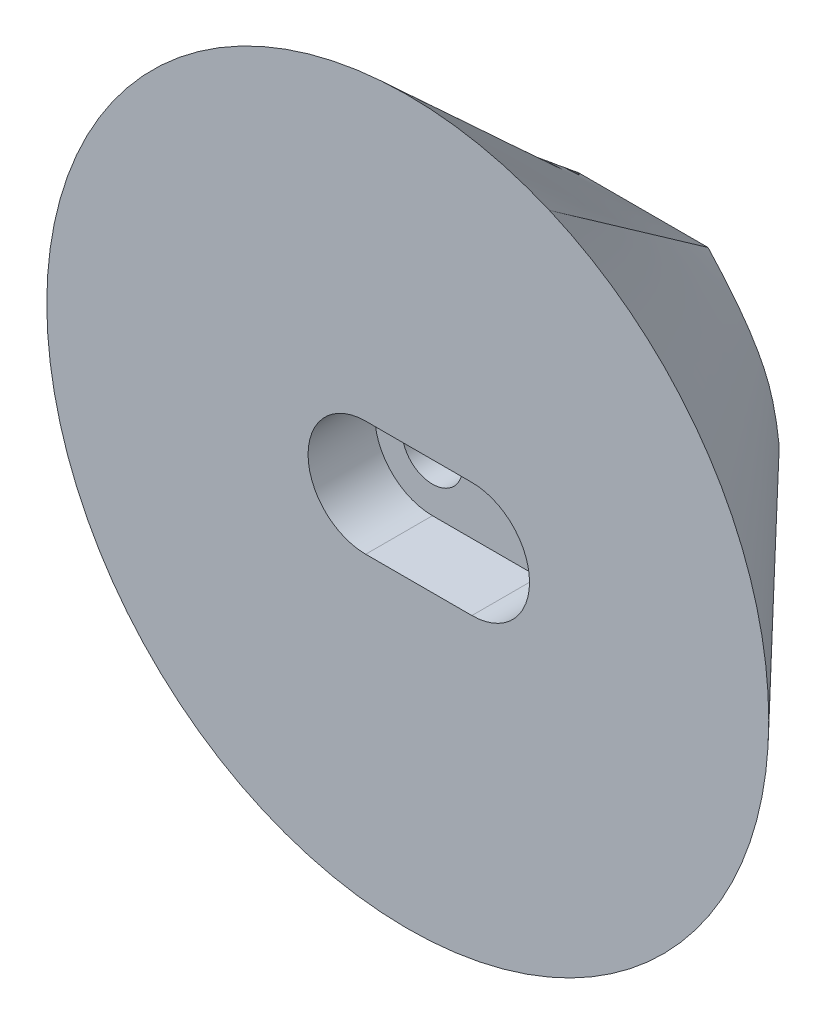
ISO-10303-21;
HEADER;
FILE_DESCRIPTION(('STEP AP214'),'2;1');
FILE_NAME('part.step','',(''),(''),'','','');
FILE_SCHEMA(('AUTOMOTIVE_DESIGN { 1 0 10303 214 1 1 1 1 }'));
ENDSEC;
DATA;
#1=APPLICATION_CONTEXT('core data for automotive mechanical design processes');
#2=APPLICATION_PROTOCOL_DEFINITION('international standard','automotive_design',2000,#1);
#3=PRODUCT_CONTEXT('',#1,'mechanical');
#4=PRODUCT('Part','Part','',(#3));
#5=PRODUCT_RELATED_PRODUCT_CATEGORY('part','',(#4));
#6=PRODUCT_DEFINITION_FORMATION('','',#4);
#7=PRODUCT_DEFINITION_CONTEXT('part definition',#1,'design');
#8=PRODUCT_DEFINITION('design','',#6,#7);
#9=PRODUCT_DEFINITION_SHAPE('','',#8);
#10=(LENGTH_UNIT() NAMED_UNIT(*) SI_UNIT(.MILLI.,.METRE.));
#11=(NAMED_UNIT(*) PLANE_ANGLE_UNIT() SI_UNIT($,.RADIAN.));
#12=(NAMED_UNIT(*) SI_UNIT($,.STERADIAN.) SOLID_ANGLE_UNIT());
#13=UNCERTAINTY_MEASURE_WITH_UNIT(LENGTH_MEASURE(1.E-05),#10,'distance_accuracy_value','');
#14=(GEOMETRIC_REPRESENTATION_CONTEXT(3) GLOBAL_UNCERTAINTY_ASSIGNED_CONTEXT((#13)) GLOBAL_UNIT_ASSIGNED_CONTEXT((#10,
#11,#12)) REPRESENTATION_CONTEXT('',''));
#15=CARTESIAN_POINT('',(0.,0.,0.));
#16=DIRECTION('',(0.,0.,1.));
#17=DIRECTION('',(1.,0.,0.));
#18=AXIS2_PLACEMENT_3D('',#15,#16,#17);
#19=CARTESIAN_POINT('',(2.11342609421527,0.,-2.));
#20=DIRECTION('',(0.,0.,1.));
#21=DIRECTION('',(1.,0.,0.));
#22=AXIS2_PLACEMENT_3D('',#19,#20,#21);
#23=CYLINDRICAL_SURFACE('',#22,1.);
#24=CARTESIAN_POINT('',(2.11342609421527,0.,0.));
#25=DIRECTION('',(0.,0.,-1.));
#26=DIRECTION('',(-1.,0.,0.));
#27=AXIS2_PLACEMENT_3D('',#24,#25,#26);
#28=CIRCLE('',#27,1.);
#29=CARTESIAN_POINT('',(1.11342609421527,0.,0.));
#30=VERTEX_POINT('',#29);
#31=EDGE_CURVE('E264',#30,#30,#28,.T.);
#32=ORIENTED_EDGE('',*,*,#31,.T.);
#33=EDGE_LOOP('',(#32));
#34=FACE_BOUND('',#33,.T.);
#35=CARTESIAN_POINT('',(2.11342609421527,0.,5.8));
#36=DIRECTION('',(0.,0.,1.));
#37=DIRECTION('',(1.,0.,0.));
#38=AXIS2_PLACEMENT_3D('',#35,#36,#37);
#39=CIRCLE('',#38,1.);
#40=CARTESIAN_POINT('',(3.11342609421527,0.,5.8));
#41=VERTEX_POINT('',#40);
#42=EDGE_CURVE('E260',#41,#41,#39,.F.);
#43=ORIENTED_EDGE('',*,*,#42,.F.);
#44=EDGE_LOOP('',(#43));
#45=FACE_BOUND('',#44,.T.);
#46=ADVANCED_FACE('F137',(#34,#45),#23,.F.);
#47=CARTESIAN_POINT('',(-1.38657390578473,0.,-2.));
#48=DIRECTION('',(0.,0.,1.));
#49=DIRECTION('',(1.,0.,0.));
#50=AXIS2_PLACEMENT_3D('',#47,#48,#49);
#51=CYLINDRICAL_SURFACE('',#50,1.);
#52=CARTESIAN_POINT('',(-1.38657390578473,0.,0.));
#53=DIRECTION('',(0.,0.,-1.));
#54=DIRECTION('',(-1.,0.,0.));
#55=AXIS2_PLACEMENT_3D('',#52,#53,#54);
#56=CIRCLE('',#55,1.);
#57=CARTESIAN_POINT('',(-2.38657390578473,0.,0.));
#58=VERTEX_POINT('',#57);
#59=EDGE_CURVE('E268',#58,#58,#56,.T.);
#60=ORIENTED_EDGE('',*,*,#59,.T.);
#61=EDGE_LOOP('',(#60));
#62=FACE_BOUND('',#61,.T.);
#63=CARTESIAN_POINT('',(-1.38657390578473,0.,5.8));
#64=DIRECTION('',(0.,0.,1.));
#65=DIRECTION('',(1.,0.,0.));
#66=AXIS2_PLACEMENT_3D('',#63,#64,#65);
#67=CIRCLE('',#66,1.);
#68=CARTESIAN_POINT('',(-0.386573905784727,0.,5.8));
#69=VERTEX_POINT('',#68);
#70=EDGE_CURVE('E142',#69,#69,#67,.F.);
#71=ORIENTED_EDGE('',*,*,#70,.F.);
#72=EDGE_LOOP('',(#71));
#73=FACE_BOUND('',#72,.T.);
#74=ADVANCED_FACE('F508',(#62,#73),#51,.F.);
#75=CARTESIAN_POINT('',(-2.9114265083145,-2.03828227090271,0.));
#76=DIRECTION('',(0.,0.,-1.));
#77=DIRECTION('',(-1.,0.,0.));
#78=AXIS2_PLACEMENT_3D('',#75,#76,#77);
#79=PLANE('',#78);
#80=ORIENTED_EDGE('',*,*,#59,.F.);
#81=EDGE_LOOP('',(#80));
#82=FACE_BOUND('',#81,.T.);
#83=ORIENTED_EDGE('',*,*,#31,.F.);
#84=EDGE_LOOP('',(#83));
#85=FACE_BOUND('',#84,.T.);
#86=CARTESIAN_POINT('',(-4.2444684424018,0.,0.));
#87=CARTESIAN_POINT('',(-4.24446844240179,-0.107452137173839,0.));
#88=CARTESIAN_POINT('',(-4.23748466742272,-0.21405566133606,0.));
#89=CARTESIAN_POINT('',(-4.1957781377489,-0.423892088590512,0.));
#90=CARTESIAN_POINT('',(-4.16070837934454,-0.527272439571958,0.));
#91=CARTESIAN_POINT('',(-4.03642800277879,-0.704643229518786,0.));
#92=CARTESIAN_POINT('',(-3.95135915448995,-0.772693372705895,0.));
#93=CARTESIAN_POINT('',(-3.76877677289554,-0.88744750748211,0.));
#94=CARTESIAN_POINT('',(-3.67237685578229,-0.936320531094865,0.));
#95=CARTESIAN_POINT('',(-3.48913373849145,-1.0499747977359,0.));
#96=CARTESIAN_POINT('',(-3.40296696979009,-1.1134642149528,0.));
#97=CARTESIAN_POINT('',(-3.25410794137238,-1.26441937833438,0.));
#98=CARTESIAN_POINT('',(-3.18968714114727,-1.35285361970208,0.));
#99=CARTESIAN_POINT('',(-3.02971312698185,-1.63004372531452,0.));
#100=CARTESIAN_POINT('',(-2.96379094531494,-1.83140529367522,0.));
#101=CARTESIAN_POINT('',(-2.85906207131406,-2.2451592481302,0.));
#102=CARTESIAN_POINT('',(-2.8220385375043,-2.45532924702613,0.));
#103=CARTESIAN_POINT('',(-2.75723498235252,-2.87636464168828,0.));
#104=CARTESIAN_POINT('',(-2.72978803805141,-3.08767854822898,0.));
#105=CARTESIAN_POINT('',(-2.67187097706575,-3.50982055733704,0.));
#106=CARTESIAN_POINT('',(-2.64207653474063,-3.72086596333578,0.));
#107=CARTESIAN_POINT('',(-2.58181607741194,-4.03414721985315,0.));
#108=CARTESIAN_POINT('',(-2.55933842948337,-4.13807708960366,0.));
#109=CARTESIAN_POINT('',(-2.51388823216451,-4.29153165547058,0.));
#110=CARTESIAN_POINT('',(-2.49689650721585,-4.34260776258866,0.));
#111=CARTESIAN_POINT('',(-2.46266282229695,-4.41485926277032,0.));
#112=CARTESIAN_POINT('',(-2.44970915023529,-4.43866246966747,0.));
#113=CARTESIAN_POINT('',(-2.4159113647867,-4.48053300000075,0.));
#114=CARTESIAN_POINT('',(-2.39304628903056,-4.49993783999961,0.));
#115=CARTESIAN_POINT('',(-2.36567545377195,-4.49999984696238,0.));
#116=B_SPLINE_CURVE_WITH_KNOTS('',3,(#86,#87,#88,#89,#90,#91,#92,#93,#94,#95,#96,#97,#98,#99,
#100,#101,#102,#103,#104,#105,#106,#107,#108,#109,#110,#111,#112,#113,#114,#115),.UNSPECIFIED.,
.F.,.F.,(4,2,2,2,2,2,2,2,2,2,2,2,2,2,4),(0.,0.0624999999999999,0.125,0.1875,0.25,0.3125,0.375,
0.5,0.625,0.75,0.875000000000001,0.937500000000001,0.968750000000001,0.984375,1.),.UNSPECIFIED.);
#117=CARTESIAN_POINT('',(-4.2444684424018,0.,0.));
#118=VERTEX_POINT('',#117);
#119=CARTESIAN_POINT('',(-2.36567544377861,-4.4999433225368,0.));
#120=VERTEX_POINT('',#119);
#121=EDGE_CURVE('E332',#118,#120,#116,.T.);
#122=ORIENTED_EDGE('',*,*,#121,.F.);
#123=CARTESIAN_POINT('',(-2.36567641502914,4.49999984477696,0.));
#124=CARTESIAN_POINT('',(-2.39266723234827,4.49993826362158,0.));
#125=CARTESIAN_POINT('',(-2.41523918985877,4.4811286371027,0.));
#126=CARTESIAN_POINT('',(-2.44901158075446,4.43975431880796,0.));
#127=CARTESIAN_POINT('',(-2.46179946218254,4.41647004850654,0.));
#128=CARTESIAN_POINT('',(-2.49620325571585,4.34447208449066,0.));
#129=CARTESIAN_POINT('',(-2.51310662561795,4.2938925011295,0.));
#130=CARTESIAN_POINT('',(-2.55863010921527,4.14100451994068,0.));
#131=CARTESIAN_POINT('',(-2.58121900656018,4.03695619625527,0.));
#132=CARTESIAN_POINT('',(-2.64162849403424,3.72377349616821,0.));
#133=CARTESIAN_POINT('',(-2.67139933409105,3.51312492128009,0.));
#134=CARTESIAN_POINT('',(-2.72926944644447,3.09158948704992,0.));
#135=CARTESIAN_POINT('',(-2.75666763726496,2.88053651848335,0.));
#136=CARTESIAN_POINT('',(-2.82120962184821,2.46023942385809,0.));
#137=CARTESIAN_POINT('',(-2.85794191936113,2.2509189216211,0.));
#138=CARTESIAN_POINT('',(-2.96181370830197,1.83792167518118,0.));
#139=CARTESIAN_POINT('',(-3.02930181937602,1.63107975854107,0.));
#140=CARTESIAN_POINT('',(-3.18903039751784,1.35383120128005,0.));
#141=CARTESIAN_POINT('',(-3.25319092695218,1.26539867427861,0.));
#142=CARTESIAN_POINT('',(-3.40339892322715,1.1129769694454,0.));
#143=CARTESIAN_POINT('',(-3.49079497620113,1.0488324233786,0.));
#144=CARTESIAN_POINT('',(-3.67411262886622,0.935358050885582,0.));
#145=CARTESIAN_POINT('',(-3.770740337577,0.886358904806014,0.));
#146=CARTESIAN_POINT('',(-3.90705110667896,0.8004666264081,0.));
#147=CARTESIAN_POINT('',(-3.95083902183506,0.769620440930179,0.));
#148=CARTESIAN_POINT('',(-4.03172144220608,0.698935538955371,0.));
#149=CARTESIAN_POINT('',(-4.06895513185411,0.658465438766408,0.));
#150=CARTESIAN_POINT('',(-4.16059758035169,0.52693048284131,0.));
#151=CARTESIAN_POINT('',(-4.1962647937693,0.422001690668502,0.));
#152=CARTESIAN_POINT('',(-4.23746728012239,0.213578666792449,0.));
#153=CARTESIAN_POINT('',(-4.2444684424018,0.107317024848092,0.));
#154=CARTESIAN_POINT('',(-4.2444684424018,0.,0.));
#155=B_SPLINE_CURVE_WITH_KNOTS('',3,(#123,#124,#125,#126,#127,#128,#129,#130,#131,#132,#133,
#134,#135,#136,#137,#138,#139,#140,#141,#142,#143,#144,#145,#146,#147,#148,#149,#150,#151,#152,
#153,#154),.UNSPECIFIED.,.F.,.F.,(4,2,2,2,2,2,2,2,2,2,2,2,2,2,2,4),(0.,0.0156250000000003,
0.0312500000000007,0.0625000000000006,0.125000000000001,0.25,0.375,0.5,0.625,0.6875,0.75,0.8125,
0.84375,0.875,0.9375,1.),.UNSPECIFIED.);
#156=CARTESIAN_POINT('',(-2.36567640349646,4.49994292130398,0.));
#157=VERTEX_POINT('',#156);
#158=EDGE_CURVE('E12',#157,#118,#155,.T.);
#159=ORIENTED_EDGE('',*,*,#158,.F.);
#160=DIRECTION('',(-0.999999999999999,-3.64033009505512E-08,0.));
#161=VECTOR('',#160,1.);
#162=CARTESIAN_POINT('',(1.89830628163759,4.50000000000001,0.));
#163=LINE('',#162,#161);
#164=CARTESIAN_POINT('',(1.89830628163759,4.50000000000001,0.));
#165=VERTEX_POINT('',#164);
#166=EDGE_CURVE('E148',#165,#157,#163,.T.);
#167=ORIENTED_EDGE('',*,*,#166,.F.);
#168=CARTESIAN_POINT('',(4.24446844240487,0.,0.));
#169=CARTESIAN_POINT('',(4.19297694506029,0.431086302225914,0.));
#170=CARTESIAN_POINT('',(4.12394759057546,0.85874194869877,0.));
#171=CARTESIAN_POINT('',(3.94453324890741,1.48538410038366,0.));
#172=CARTESIAN_POINT('',(3.87116008839568,1.68994340914965,0.));
#173=CARTESIAN_POINT('',(3.69485829722378,2.08357662911512,0.));
#174=CARTESIAN_POINT('',(3.59202500957753,2.27356174145487,0.));
#175=CARTESIAN_POINT('',(3.26500305794106,2.83489902735797,0.));
#176=CARTESIAN_POINT('',(3.01342528947052,3.18642479209752,0.));
#177=CARTESIAN_POINT('',(2.47470252128366,3.85804242651396,0.));
#178=CARTESIAN_POINT('',(2.18944713101147,4.18133800367739,0.));
#179=CARTESIAN_POINT('',(1.89830628163759,4.50000000000001,0.));
#180=B_SPLINE_CURVE_WITH_KNOTS('',3,(#168,#169,#170,#171,#172,#173,#174,#175,#176,#177,#178,
#179),.UNSPECIFIED.,.F.,.F.,(4,2,2,2,2,4),(0.,0.25,0.375,0.5,0.75,1.),.UNSPECIFIED.);
#181=CARTESIAN_POINT('',(4.24446844240487,0.,0.));
#182=VERTEX_POINT('',#181);
#183=EDGE_CURVE('E361',#182,#165,#180,.T.);
#184=ORIENTED_EDGE('',*,*,#183,.F.);
#185=CARTESIAN_POINT('',(1.89830650510485,-4.5,0.));
#186=CARTESIAN_POINT('',(2.19200070628004,-4.17854326209063,0.));
#187=CARTESIAN_POINT('',(2.47995771776774,-3.85217511479614,0.));
#188=CARTESIAN_POINT('',(3.02418199148064,-3.17231032341502,0.));
#189=CARTESIAN_POINT('',(3.2763242879497,-2.81772039178051,0.));
#190=CARTESIAN_POINT('',(3.60313341251355,-2.25327797647636,0.));
#191=CARTESIAN_POINT('',(3.70654167461264,-2.06033453664315,0.));
#192=CARTESIAN_POINT('',(3.88015540069077,-1.66665892962217,0.));
#193=CARTESIAN_POINT('',(3.95094083297796,-1.46535857564933,0.));
#194=CARTESIAN_POINT('',(4.12480901608936,-0.850737175923852,0.));
#195=CARTESIAN_POINT('',(4.19336944819392,-0.427800410342597,0.));
#196=CARTESIAN_POINT('',(4.24446844240487,0.,0.));
#197=B_SPLINE_CURVE_WITH_KNOTS('',3,(#185,#186,#187,#188,#189,#190,#191,#192,#193,#194,#195,
#196),.UNSPECIFIED.,.F.,.F.,(4,2,2,2,2,4),(0.,0.25,0.5,0.625,0.75,1.),.UNSPECIFIED.);
#198=CARTESIAN_POINT('',(1.89830650510485,-4.5,0.));
#199=VERTEX_POINT('',#198);
#200=EDGE_CURVE('E365',#199,#182,#197,.T.);
#201=ORIENTED_EDGE('',*,*,#200,.F.);
#202=DIRECTION('',(0.999999999999999,-3.58907760665152E-08,0.));
#203=VECTOR('',#202,1.);
#204=CARTESIAN_POINT('',(-2.36567545377195,-4.49999984696238,0.));
#205=LINE('',#204,#203);
#206=EDGE_CURVE('E385',#120,#199,#205,.T.);
#207=ORIENTED_EDGE('',*,*,#206,.F.);
#208=EDGE_LOOP('',(#122,#159,#167,#184,#201,#207));
#209=FACE_BOUND('',#208,.T.);
#210=ADVANCED_FACE('F139',(#82,#85,#209),#79,.T.);
#211=CARTESIAN_POINT('',(0.,0.,8.));
#212=DIRECTION('',(0.,0.,1.));
#213=DIRECTION('',(1.,0.,0.));
#214=AXIS2_PLACEMENT_3D('',#211,#212,#213);
#215=PLANE('',#214);
#216=CARTESIAN_POINT('',(-1.38657390578473,0.,8.));
#217=DIRECTION('',(0.,0.,1.));
#218=DIRECTION('',(1.,0.,0.));
#219=AXIS2_PLACEMENT_3D('',#216,#217,#218);
#220=CIRCLE('',#219,1.9);
#221=CARTESIAN_POINT('',(-1.38657390578473,1.9,8.));
#222=VERTEX_POINT('',#221);
#223=CARTESIAN_POINT('',(-1.38657390578473,-1.9,8.));
#224=VERTEX_POINT('',#223);
#225=EDGE_CURVE('E156',#222,#224,#220,.T.);
#226=ORIENTED_EDGE('',*,*,#225,.F.);
#227=DIRECTION('',(-1.,0.,0.));
#228=VECTOR('',#227,1.);
#229=CARTESIAN_POINT('',(-1.38657390578473,1.9,8.));
#230=LINE('',#229,#228);
#231=CARTESIAN_POINT('',(2.11342609421527,1.9,8.));
#232=VERTEX_POINT('',#231);
#233=EDGE_CURVE('E233',#232,#222,#230,.T.);
#234=ORIENTED_EDGE('',*,*,#233,.F.);
#235=CARTESIAN_POINT('',(2.11342609421527,0.,8.));
#236=DIRECTION('',(0.,0.,1.));
#237=DIRECTION('',(1.,0.,0.));
#238=AXIS2_PLACEMENT_3D('',#235,#236,#237);
#239=CIRCLE('',#238,1.9);
#240=CARTESIAN_POINT('',(2.11342609421527,-1.9,8.));
#241=VERTEX_POINT('',#240);
#242=EDGE_CURVE('E237',#241,#232,#239,.T.);
#243=ORIENTED_EDGE('',*,*,#242,.F.);
#244=DIRECTION('',(1.,0.,0.));
#245=VECTOR('',#244,1.);
#246=CARTESIAN_POINT('',(2.11342609421527,-1.9,8.));
#247=LINE('',#246,#245);
#248=EDGE_CURVE('E246',#224,#241,#247,.T.);
#249=ORIENTED_EDGE('',*,*,#248,.F.);
#250=EDGE_LOOP('',(#226,#234,#243,#249));
#251=FACE_BOUND('',#250,.T.);
#252=CARTESIAN_POINT('',(0.,0.,8.));
#253=DIRECTION('',(0.,0.,1.));
#254=DIRECTION('',(1.,0.,0.));
#255=AXIS2_PLACEMENT_3D('',#252,#253,#254);
#256=CIRCLE('',#255,11.9);
#257=CARTESIAN_POINT('',(11.9,0.,8.));
#258=VERTEX_POINT('',#257);
#259=CARTESIAN_POINT('',(4.6694551021903,10.94560135619,8.));
#260=VERTEX_POINT('',#259);
#261=EDGE_CURVE('E284',#258,#260,#256,.T.);
#262=ORIENTED_EDGE('',*,*,#261,.T.);
#263=CARTESIAN_POINT('',(4.66574204916294,-10.9471846212016,8.));
#264=VERTEX_POINT('',#263);
#265=EDGE_CURVE('E289',#260,#264,#256,.T.);
#266=ORIENTED_EDGE('',*,*,#265,.T.);
#267=EDGE_CURVE('E272',#264,#258,#256,.T.);
#268=ORIENTED_EDGE('',*,*,#267,.T.);
#269=EDGE_LOOP('',(#262,#266,#268));
#270=FACE_BOUND('',#269,.T.);
#271=ADVANCED_FACE('F300',(#251,#270),#215,.T.);
#272=CARTESIAN_POINT('',(4.66574204916294,-10.9471846212016,8.));
#273=CARTESIAN_POINT('',(1.89830650510485,-4.5,0.));
#274=CARTESIAN_POINT('',(3.85993434268277,-11.2906236906755,8.));
#275=CARTESIAN_POINT('',(1.54304608941592,-4.49999998724943,0.));
#276=CARTESIAN_POINT('',(2.17549452297418,-11.7976913152476,7.99999999999999));
#277=CARTESIAN_POINT('',(0.831169508822543,-4.49999996169963,0.));
#278=CARTESIAN_POINT('',(-0.453482190442536,-11.9880373089424,8.));
#279=CARTESIAN_POINT('',(-0.237748136598312,-4.49999992333534,0.));
#280=CARTESIAN_POINT('',(-3.06527997386312,-11.5990943888442,8.));
#281=CARTESIAN_POINT('',(-1.30477028316707,-4.49999988503909,0.));
#282=CARTESIAN_POINT('',(-4.7150898285087,-10.9615860497293,8.));
#283=CARTESIAN_POINT('',(-2.012890492807,-4.49999985962411,0.));
#284=CARTESIAN_POINT('',(-5.55714336690334,-10.5229590487391,8.));
#285=CARTESIAN_POINT('',(-2.39252561541209,-4.49993901955403,0.));
#286=CARTESIAN_POINT('',(-5.67575219924305,-10.4598856245235,8.));
#287=CARTESIAN_POINT('',(-2.43738553419538,-4.46223829928458,0.));
#288=CARTESIAN_POINT('',(-5.91087822578323,-10.329675898132,8.));
#289=CARTESIAN_POINT('',(-2.48786807979208,-4.36821050379471,0.));
#290=CARTESIAN_POINT('',(-6.20073664296994,-10.1593756117004,8.));
#291=CARTESIAN_POINT('',(-2.53133141781433,-4.24038350139115,0.));
#292=CARTESIAN_POINT('',(-6.54168081568449,-9.94320951922187,8.));
#293=CARTESIAN_POINT('',(-2.57076312772479,-4.08482491057227,0.));
#294=CARTESIAN_POINT('',(-6.87533171816165,-9.71549293472967,8.));
#295=CARTESIAN_POINT('',(-2.60310697427627,-3.92717914029228,0.));
#296=CARTESIAN_POINT('',(-7.20128200807352,-9.47648111497068,8.));
#297=CARTESIAN_POINT('',(-2.63132738020494,-3.76916585010064,0.));
#298=CARTESIAN_POINT('',(-7.51912434309223,-9.2264293166918,8.));
#299=CARTESIAN_POINT('',(-2.65664052206415,-3.61059407280036,0.));
#300=CARTESIAN_POINT('',(-7.82845138088987,-8.96559279663993,8.));
#301=CARTESIAN_POINT('',(-2.67970683253639,-3.45185080129107,0.));
#302=CARTESIAN_POINT('',(-8.22899057855481,-8.60377148320266,8.));
#303=CARTESIAN_POINT('',(-2.70905457441044,-3.2400550965904,0.));
#304=CARTESIAN_POINT('',(-8.70633962094388,-8.12580932070811,8.));
#305=CARTESIAN_POINT('',(-2.74438696022172,-2.97533422202219,0.));
#306=CARTESIAN_POINT('',(-9.23929831317363,-7.51411686340591,8.));
#307=CARTESIAN_POINT('',(-2.78957399246634,-2.65829625880346,0.));
#308=CARTESIAN_POINT('',(-9.7298566156364,-6.86724551460297,8.));
#309=CARTESIAN_POINT('',(-2.84195174668624,-2.34253251705454,0.));
#310=CARTESIAN_POINT('',(-10.1754742972024,-6.18815424510731,8.));
#311=CARTESIAN_POINT('',(-2.90961488306385,-2.02976523763514,0.));
#312=CARTESIAN_POINT('',(-10.5736111267418,-5.47980202572691,8.));
#313=CARTESIAN_POINT('',(-2.99961000834307,-1.72259772454898,0.));
#314=CARTESIAN_POINT('',(-10.9226805264482,-4.7457712440062,8.));
#315=CARTESIAN_POINT('',(-3.13199068354039,-1.43015256431769,0.));
#316=CARTESIAN_POINT('',(-11.2210959185151,-3.98964428748959,8.));
#317=CARTESIAN_POINT('',(-3.32361370969701,-1.17128370760481,0.));
#318=CARTESIAN_POINT('',(-11.4672707251361,-3.21500354372149,8.));
#319=CARTESIAN_POINT('',(-3.58481368498448,-0.979310336482026,0.));
#320=CARTESIAN_POINT('',(-11.6596183685049,-2.4254314002463,8.));
#321=CARTESIAN_POINT('',(-3.86891622174462,-0.839029018114741,0.));
#322=CARTESIAN_POINT('',(-11.7976955407047,-1.62480180371426,8.));
#323=CARTESIAN_POINT('',(-4.12505810166959,-0.631394522819646,0.));
#324=CARTESIAN_POINT('',(-11.8810589338189,-0.816988700775598,8.));
#325=CARTESIAN_POINT('',(-4.23132512871229,-0.319051212421528,0.));
#326=CARTESIAN_POINT('',(-11.8998631378935,-0.276240258978888,8.));
#327=CARTESIAN_POINT('',(-4.24446844240179,-0.106750790046275,0.));
#328=CARTESIAN_POINT('',(-11.9001339189774,0.264403875911391,8.));
#329=CARTESIAN_POINT('',(-4.2444684424018,0.106777791048696,0.));
#330=CARTESIAN_POINT('',(-11.8818595071714,0.805353742043817,8.));
#331=CARTESIAN_POINT('',(-4.23136265889481,0.318730279270968,0.));
#332=CARTESIAN_POINT('',(-11.7992451539168,1.61356088468509,8.));
#333=CARTESIAN_POINT('',(-4.12485326856211,0.631793538288452,0.));
#334=CARTESIAN_POINT('',(-11.6618610341875,2.41466698665973,8.));
#335=CARTESIAN_POINT('',(-3.86902230088112,0.839152619103987,0.));
#336=CARTESIAN_POINT('',(-11.4701401170542,3.20478866385846,8.));
#337=CARTESIAN_POINT('',(-3.58449512953692,0.979362999633128,0.));
#338=CARTESIAN_POINT('',(-11.2245153715877,3.98004253217201,8.));
#339=CARTESIAN_POINT('',(-3.32355805099622,1.17146979288737,0.));
#340=CARTESIAN_POINT('',(-10.9265699675316,4.73683364967822,8.));
#341=CARTESIAN_POINT('',(-3.13177386305076,1.43028953136788,0.));
#342=CARTESIAN_POINT('',(-10.5778870746295,5.47156707445495,8.));
#343=CARTESIAN_POINT('',(-2.99983797984015,1.72292790186589,0.));
#344=CARTESIAN_POINT('',(-10.1800498626251,6.18064786458004,8.));
#345=CARTESIAN_POINT('',(-2.90948547341185,2.02995082374523,0.));
#346=CARTESIAN_POINT('',(-9.73464150126193,6.86048107813135,8.));
#347=CARTESIAN_POINT('',(-2.84194713813248,2.34274746059063,0.));
#348=CARTESIAN_POINT('',(-9.24420583434319,7.50809632251889,8.));
#349=CARTESIAN_POINT('',(-2.78952655792485,2.65846630545879,0.));
#350=CARTESIAN_POINT('',(-8.71128670567195,8.12052320515266,8.));
#351=CARTESIAN_POINT('',(-2.74438087923634,2.97549093744171,0.));
#352=CARTESIAN_POINT('',(-8.23390441682141,8.59907997872767,8.));
#353=CARTESIAN_POINT('',(-2.70903132825245,3.24017953740912,0.));
#354=CARTESIAN_POINT('',(-7.83330069866782,8.96136082412081,8.));
#355=CARTESIAN_POINT('',(-2.6796928413727,3.45195842372933,0.));
#356=CARTESIAN_POINT('',(-7.52390738509627,9.22253305654274,8.));
#357=CARTESIAN_POINT('',(-2.65662927955913,3.61068541164999,0.));
#358=CARTESIAN_POINT('',(-7.20598196514857,9.47291077245227,8.));
#359=CARTESIAN_POINT('',(-2.6313246315607,3.76924399784136,0.));
#360=CARTESIAN_POINT('',(-6.87993285740495,9.7122378569599,8.));
#361=CARTESIAN_POINT('',(-2.60309262404227,3.92723952709503,0.));
#362=CARTESIAN_POINT('',(-6.54616848044561,9.94025819517615,8.));
#363=CARTESIAN_POINT('',(-2.57074876298575,4.08487102800617,0.));
#364=CARTESIAN_POINT('',(-6.20509725285077,10.1567156722115,8.));
#365=CARTESIAN_POINT('',(-2.53132824687867,4.24041738542252,0.));
#366=CARTESIAN_POINT('',(-5.91512253647566,10.3272477563491,8.));
#367=CARTESIAN_POINT('',(-2.48786130091047,4.36823186057706,0.));
#368=CARTESIAN_POINT('',(-5.67989775663805,10.4576358781792,8.));
#369=CARTESIAN_POINT('',(-2.43738468658693,4.46225516972907,0.));
#370=CARTESIAN_POINT('',(-5.56123773268841,10.5207960810268,8.));
#371=CARTESIAN_POINT('',(-2.39252478357533,4.49993858862693,0.));
#372=CARTESIAN_POINT('',(-4.71874414662876,10.9600653123915,8.));
#373=CARTESIAN_POINT('',(-2.01286235484905,4.49999985762056,0.));
#374=CARTESIAN_POINT('',(-3.06766167489227,11.5986615677405,7.99999999999999));
#375=CARTESIAN_POINT('',(-1.30478254393375,4.499999883397,0.));
#376=CARTESIAN_POINT('',(-0.453285965647945,11.9882351558798,8.00000000000001));
#377=CARTESIAN_POINT('',(-0.237932695976863,4.49999992223386,0.));
#378=CARTESIAN_POINT('',(2.17807719713768,11.7973741710099,8.));
#379=CARTESIAN_POINT('',(0.8308970812431,4.49999996114279,0.));
#380=CARTESIAN_POINT('',(3.86343987928637,11.2894519837212,8.));
#381=CARTESIAN_POINT('',(1.54290297603123,4.49999998706216,0.));
#382=CARTESIAN_POINT('',(4.6694551021903,10.94560135619,8.));
#383=CARTESIAN_POINT('',(1.89830628163759,4.50000000000001,0.));
#384=B_SPLINE_SURFACE_WITH_KNOTS('',3,1,((#272,#273),(#274,#275),(#276,#277),(#278,#279),(#280,
#281),(#282,#283),(#284,#285),(#286,#287),(#288,#289),(#290,#291),(#292,#293),(#294,#295),(#296,
#297),(#298,#299),(#300,#301),(#302,#303),(#304,#305),(#306,#307),(#308,#309),(#310,#311),(#312,
#313),(#314,#315),(#316,#317),(#318,#319),(#320,#321),(#322,#323),(#324,#325),(#326,#327),(#328,
#329),(#330,#331),(#332,#333),(#334,#335),(#336,#337),(#338,#339),(#340,#341),(#342,#343),(#344,
#345),(#346,#347),(#348,#349),(#350,#351),(#352,#353),(#354,#355),(#356,#357),(#358,#359),(#360,
#361),(#362,#363),(#364,#365),(#366,#367),(#368,#369),(#370,#371),(#372,#373),(#374,#375),(#376,
#377),(#378,#379),(#380,#381),(#382,#383)),.UNSPECIFIED.,.F.,.F.,.F.,(4,1,1,1,2,1,1,1,1,1,1,1,1,
1,1,1,1,1,1,1,1,1,1,1,1,2,1,1,1,1,1,1,1,1,1,1,1,1,1,1,1,1,1,1,1,1,2,1,1,1,4),(2,2),(0.,
0.0563524364178859,0.112704872835772,0.169057309253658,0.225409745671543,0.229698845005217,
0.23398794433889,0.242566143006236,0.251144341673582,0.259722540340928,0.268300739008274,
0.27687893767562,0.285457136342966,0.294035335010312,0.311191732345005,0.328348129679697,
0.345504527014389,0.362660924349081,0.379817321683773,0.396973719018466,0.414130116353158,
0.43128651368785,0.448442911022542,0.465599308357234,0.482755705691927,0.499912103026619,
0.517073821079811,0.534235539133003,0.551397257186195,0.568558975239386,0.585720693292578,
0.60288241134577,0.620044129398962,0.637205847452154,0.654367565505346,0.671529283558538,
0.68869100161173,0.705852719664922,0.714433578691518,0.723014437718114,0.73159529674471,
0.740176155771306,0.748757014797902,0.757337873824498,0.765918732851094,0.770209162364392,
0.77449959187769,0.830874693908267,0.887249795938845,0.943624897969422,1.),(0.,1.),.UNSPECIFIED.);
#385=DIRECTION('',(-0.260428556134103,-0.605748288276259,-0.751828423511833));
#386=VECTOR('',#385,1.);
#387=CARTESIAN_POINT('',(3.28388069191395,7.72280067809502,4.));
#388=LINE('',#387,#386);
#389=EDGE_CURVE('E404',#260,#165,#388,.T.);
#390=DIRECTION('',(0.260079764191311,-0.605897492203621,0.75182893346795));
#391=VECTOR('',#390,1.);
#392=CARTESIAN_POINT('',(3.2820242771339,-7.7235923106008,4.));
#393=LINE('',#392,#391);
#394=EDGE_CURVE('E288',#199,#264,#393,.T.);
#395=ORIENTED_EDGE('',*,*,#265,.F.);
#396=ORIENTED_EDGE('',*,*,#389,.T.);
#397=ORIENTED_EDGE('',*,*,#166,.T.);
#398=ORIENTED_EDGE('',*,*,#158,.T.);
#399=ORIENTED_EDGE('',*,*,#121,.T.);
#400=ORIENTED_EDGE('',*,*,#206,.T.);
#401=ORIENTED_EDGE('',*,*,#394,.T.);
#402=EDGE_LOOP('',(#395,#396,#397,#398,#399,#400,#401));
#403=FACE_BOUND('',#402,.T.);
#404=ADVANCED_FACE('F310',(#403),#384,.T.);
#405=CARTESIAN_POINT('',(4.6694551021903,10.94560135619,8.));
#406=CARTESIAN_POINT('',(1.89830628163759,4.50000000000001,0.));
#407=CARTESIAN_POINT('',(5.76550840964535,10.4780188504674,8.));
#408=CARTESIAN_POINT('',(2.18944713101147,4.18133800367739,0.));
#409=CARTESIAN_POINT('',(7.26541197440631,9.54804060723359,8.));
#410=CARTESIAN_POINT('',(2.61705626621112,3.69693431941331,0.));
#411=CARTESIAN_POINT('',(8.91559700251811,7.94370746982782,8.));
#412=CARTESIAN_POINT('',(3.14001731149379,3.01152750680901,0.));
#413=CARTESIAN_POINT('',(9.96305917813569,6.58148824927791,8.00000000000001));
#414=CARTESIAN_POINT('',(3.49003075510242,2.46450266609075,0.));
#415=CARTESIAN_POINT('',(10.8050113586055,5.08351136695052,8.));
#416=CARTESIAN_POINT('',(3.79755420795364,1.89390365159486,0.));
#417=CARTESIAN_POINT('',(11.4261201442459,3.47298852856371,8.));
#418=CARTESIAN_POINT('',(4.01768581246952,1.28043239554276,0.));
#419=CARTESIAN_POINT('',(11.8110521353753,1.77313143983557,8.));
#420=CARTESIAN_POINT('',(4.15811239914993,0.644189437720584,0.));
#421=CARTESIAN_POINT('',(11.9,0.595811684267985,8.));
#422=CARTESIAN_POINT('',(4.21872269373258,0.215543151112958,0.));
#423=CARTESIAN_POINT('',(11.9,0.,8.));
#424=CARTESIAN_POINT('',(4.24446844240487,0.,0.));
#425=B_SPLINE_SURFACE_WITH_KNOTS('',3,1,((#405,#406),(#407,#408),(#409,#410),(#411,#412),(#413,
#414),(#415,#416),(#417,#418),(#419,#420),(#421,#422),(#423,#424)),.UNSPECIFIED.,.F.,.F.,.F.,(4,
1,1,1,1,1,1,4),(2,2),(0.,0.25,0.375,0.5,0.625,0.75,0.875,1.),(0.,1.),.UNSPECIFIED.);
#426=DIRECTION('',(-0.691380981178733,0.,-0.722490372852353));
#427=VECTOR('',#426,1.);
#428=CARTESIAN_POINT('',(8.07223422120244,0.,4.));
#429=LINE('',#428,#427);
#430=EDGE_CURVE('E401',#258,#182,#429,.T.);
#431=ORIENTED_EDGE('',*,*,#261,.F.);
#432=ORIENTED_EDGE('',*,*,#430,.T.);
#433=ORIENTED_EDGE('',*,*,#183,.T.);
#434=ORIENTED_EDGE('',*,*,#389,.F.);
#435=EDGE_LOOP('',(#431,#432,#433,#434));
#436=FACE_BOUND('',#435,.T.);
#437=ADVANCED_FACE('F426',(#436),#425,.T.);
#438=CARTESIAN_POINT('',(11.9,0.,8.));
#439=CARTESIAN_POINT('',(4.24446844240487,0.,0.));
#440=CARTESIAN_POINT('',(11.9,-0.595994863290694,8.));
#441=CARTESIAN_POINT('',(4.2189189452994,-0.2139002051713,0.));
#442=CARTESIAN_POINT('',(11.8109980483164,-1.77366738573297,8.));
#443=CARTESIAN_POINT('',(4.15878473650779,-0.639072215154253,0.));
#444=CARTESIAN_POINT('',(11.4258400010229,-3.47399517611475,8.));
#445=CARTESIAN_POINT('',(4.02135668089967,-1.26416097630407,0.));
#446=CARTESIAN_POINT('',(10.804377569244,-5.0849125923506,8.));
#447=CARTESIAN_POINT('',(3.80940483661335,-1.86754946840086,0.));
#448=CARTESIAN_POINT('',(9.96196148826225,-6.58319025357621,8.00000000000001));
#449=CARTESIAN_POINT('',(3.50091347272177,-2.44651898014972,0.));
#450=CARTESIAN_POINT('',(8.91394249336044,-7.94559877892728,8.));
#451=CARTESIAN_POINT('',(3.15156806461425,-2.99495024769562,0.));
#452=CARTESIAN_POINT('',(7.26291426197479,-9.55001212374359,7.99999999999999));
#453=CARTESIAN_POINT('',(2.6234676073439,-3.69009643089916,0.));
#454=CARTESIAN_POINT('',(5.76229092340345,-10.4798302859511,8.));
#455=CARTESIAN_POINT('',(2.19200070628004,-4.17854326209063,0.));
#456=CARTESIAN_POINT('',(4.66574204916294,-10.9471846212016,8.));
#457=CARTESIAN_POINT('',(1.89830650510485,-4.5,0.));
#458=B_SPLINE_SURFACE_WITH_KNOTS('',3,1,((#438,#439),(#440,#441),(#442,#443),(#444,#445),(#446,
#447),(#448,#449),(#450,#451),(#452,#453),(#454,#455),(#456,#457)),.UNSPECIFIED.,.F.,.F.,.F.,(4,
1,1,1,1,1,1,4),(2,2),(0.,0.125,0.25,0.375,0.5,0.625,0.75,1.),(0.,1.),.UNSPECIFIED.);
#459=ORIENTED_EDGE('',*,*,#267,.F.);
#460=ORIENTED_EDGE('',*,*,#394,.F.);
#461=ORIENTED_EDGE('',*,*,#200,.T.);
#462=ORIENTED_EDGE('',*,*,#430,.F.);
#463=EDGE_LOOP('',(#459,#460,#461,#462));
#464=FACE_BOUND('',#463,.T.);
#465=ADVANCED_FACE('F436',(#464),#458,.T.);
#466=CARTESIAN_POINT('',(-1.38657390578473,0.,5.8));
#467=DIRECTION('',(0.,0.,1.));
#468=DIRECTION('',(1.,0.,0.));
#469=AXIS2_PLACEMENT_3D('',#466,#467,#468);
#470=PLANE('',#469);
#471=CARTESIAN_POINT('',(-1.38657390578473,0.,5.8));
#472=DIRECTION('',(0.,0.,1.));
#473=DIRECTION('',(1.,0.,0.));
#474=AXIS2_PLACEMENT_3D('',#471,#472,#473);
#475=CIRCLE('',#474,1.9);
#476=CARTESIAN_POINT('',(-1.38657390578473,1.9,5.8));
#477=VERTEX_POINT('',#476);
#478=CARTESIAN_POINT('',(-1.38657390578473,-1.9,5.8));
#479=VERTEX_POINT('',#478);
#480=EDGE_CURVE('E211',#477,#479,#475,.T.);
#481=ORIENTED_EDGE('',*,*,#480,.T.);
#482=DIRECTION('',(1.,0.,0.));
#483=VECTOR('',#482,1.);
#484=CARTESIAN_POINT('',(2.11342609421527,-1.9,5.8));
#485=LINE('',#484,#483);
#486=CARTESIAN_POINT('',(2.11342609421527,-1.9,5.8));
#487=VERTEX_POINT('',#486);
#488=EDGE_CURVE('E221',#479,#487,#485,.T.);
#489=ORIENTED_EDGE('',*,*,#488,.T.);
#490=CARTESIAN_POINT('',(2.11342609421527,0.,5.8));
#491=DIRECTION('',(0.,0.,1.));
#492=DIRECTION('',(1.,0.,0.));
#493=AXIS2_PLACEMENT_3D('',#490,#491,#492);
#494=CIRCLE('',#493,1.9);
#495=CARTESIAN_POINT('',(2.11342609421527,1.9,5.8));
#496=VERTEX_POINT('',#495);
#497=EDGE_CURVE('E227',#487,#496,#494,.T.);
#498=ORIENTED_EDGE('',*,*,#497,.T.);
#499=DIRECTION('',(-1.,0.,0.));
#500=VECTOR('',#499,1.);
#501=CARTESIAN_POINT('',(-1.38657390578473,1.9,5.8));
#502=LINE('',#501,#500);
#503=EDGE_CURVE('E218',#496,#477,#502,.T.);
#504=ORIENTED_EDGE('',*,*,#503,.T.);
#505=EDGE_LOOP('',(#481,#489,#498,#504));
#506=FACE_BOUND('',#505,.T.);
#507=ORIENTED_EDGE('',*,*,#70,.T.);
#508=EDGE_LOOP('',(#507));
#509=FACE_BOUND('',#508,.T.);
#510=ORIENTED_EDGE('',*,*,#42,.T.);
#511=EDGE_LOOP('',(#510));
#512=FACE_BOUND('',#511,.T.);
#513=ADVANCED_FACE('F229',(#506,#509,#512),#470,.T.);
#514=CARTESIAN_POINT('',(-1.38657390578473,0.,5.8));
#515=DIRECTION('',(0.,0.,1.));
#516=DIRECTION('',(1.,0.,0.));
#517=AXIS2_PLACEMENT_3D('',#514,#515,#516);
#518=CYLINDRICAL_SURFACE('',#517,1.9);
#519=ORIENTED_EDGE('',*,*,#225,.T.);
#520=DIRECTION('',(0.,0.,1.));
#521=VECTOR('',#520,1.);
#522=CARTESIAN_POINT('',(-1.38657390578473,-1.9,5.8));
#523=LINE('',#522,#521);
#524=EDGE_CURVE('E207',#479,#224,#523,.T.);
#525=ORIENTED_EDGE('',*,*,#524,.F.);
#526=ORIENTED_EDGE('',*,*,#480,.F.);
#527=DIRECTION('',(0.,0.,1.));
#528=VECTOR('',#527,1.);
#529=CARTESIAN_POINT('',(-1.38657390578473,1.9,5.8));
#530=LINE('',#529,#528);
#531=EDGE_CURVE('E252',#477,#222,#530,.T.);
#532=ORIENTED_EDGE('',*,*,#531,.T.);
#533=EDGE_LOOP('',(#519,#525,#526,#532));
#534=FACE_BOUND('',#533,.T.);
#535=ADVANCED_FACE('F209',(#534),#518,.F.);
#536=CARTESIAN_POINT('',(-1.38657390578473,1.9,5.8));
#537=DIRECTION('',(0.,1.,0.));
#538=DIRECTION('',(-1.,0.,0.));
#539=AXIS2_PLACEMENT_3D('',#536,#537,#538);
#540=PLANE('',#539);
#541=ORIENTED_EDGE('',*,*,#233,.T.);
#542=ORIENTED_EDGE('',*,*,#531,.F.);
#543=ORIENTED_EDGE('',*,*,#503,.F.);
#544=DIRECTION('',(0.,0.,1.));
#545=VECTOR('',#544,1.);
#546=CARTESIAN_POINT('',(2.11342609421527,1.9,5.8));
#547=LINE('',#546,#545);
#548=EDGE_CURVE('E255',#496,#232,#547,.T.);
#549=ORIENTED_EDGE('',*,*,#548,.T.);
#550=EDGE_LOOP('',(#541,#542,#543,#549));
#551=FACE_BOUND('',#550,.T.);
#552=ADVANCED_FACE('F575',(#551),#540,.F.);
#553=CARTESIAN_POINT('',(2.11342609421527,0.,5.8));
#554=DIRECTION('',(0.,0.,1.));
#555=DIRECTION('',(1.,0.,0.));
#556=AXIS2_PLACEMENT_3D('',#553,#554,#555);
#557=CYLINDRICAL_SURFACE('',#556,1.9);
#558=ORIENTED_EDGE('',*,*,#242,.T.);
#559=ORIENTED_EDGE('',*,*,#548,.F.);
#560=ORIENTED_EDGE('',*,*,#497,.F.);
#561=DIRECTION('',(0.,0.,1.));
#562=VECTOR('',#561,1.);
#563=CARTESIAN_POINT('',(2.11342609421527,-1.9,5.8));
#564=LINE('',#563,#562);
#565=EDGE_CURVE('E217',#487,#241,#564,.T.);
#566=ORIENTED_EDGE('',*,*,#565,.T.);
#567=EDGE_LOOP('',(#558,#559,#560,#566));
#568=FACE_BOUND('',#567,.T.);
#569=ADVANCED_FACE('F584',(#568),#557,.F.);
#570=CARTESIAN_POINT('',(2.11342609421527,-1.9,5.8));
#571=DIRECTION('',(0.,-1.,0.));
#572=DIRECTION('',(1.,0.,0.));
#573=AXIS2_PLACEMENT_3D('',#570,#571,#572);
#574=PLANE('',#573);
#575=ORIENTED_EDGE('',*,*,#248,.T.);
#576=ORIENTED_EDGE('',*,*,#565,.F.);
#577=ORIENTED_EDGE('',*,*,#488,.F.);
#578=ORIENTED_EDGE('',*,*,#524,.T.);
#579=EDGE_LOOP('',(#575,#576,#577,#578));
#580=FACE_BOUND('',#579,.T.);
#581=ADVANCED_FACE('F222',(#580),#574,.F.);
#582=CLOSED_SHELL('',(#46,#74,#210,#271,#404,#437,#465,#513,#535,#552,#569,#581));
#583=MANIFOLD_SOLID_BREP('B2',#582);
#584=ADVANCED_BREP_SHAPE_REPRESENTATION('',(#18,#583),#14);
#585=SHAPE_DEFINITION_REPRESENTATION(#9,#584);
ENDSEC;
END-ISO-10303-21;
